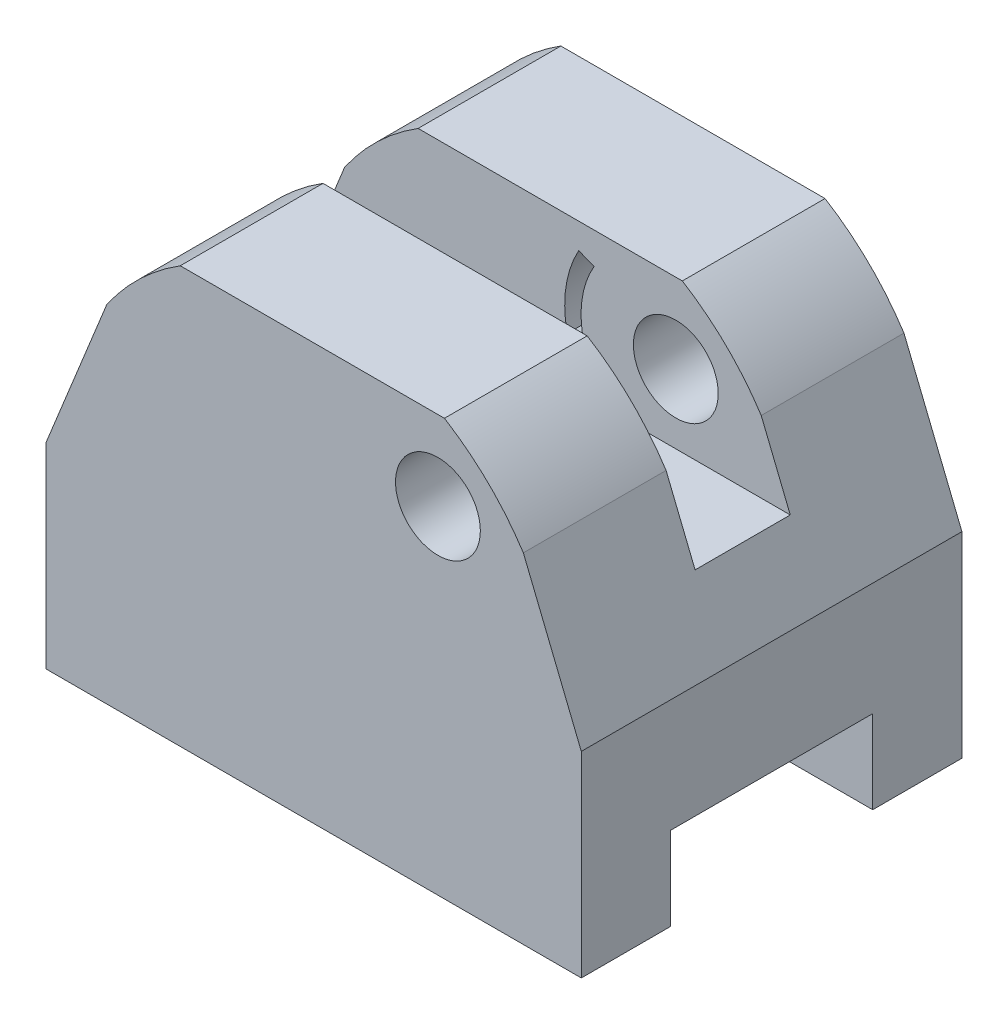
ISO-10303-21;
HEADER;
FILE_DESCRIPTION(('STEP AP214'),'2;1');
FILE_NAME('part.step','',(''),(''),'','','');
FILE_SCHEMA(('AUTOMOTIVE_DESIGN { 1 0 10303 214 1 1 1 1 }'));
ENDSEC;
DATA;
#1=APPLICATION_CONTEXT('core data for automotive mechanical design processes');
#2=APPLICATION_PROTOCOL_DEFINITION('international standard','automotive_design',2000,#1);
#3=PRODUCT_CONTEXT('',#1,'mechanical');
#4=PRODUCT('Part','Part','',(#3));
#5=PRODUCT_RELATED_PRODUCT_CATEGORY('part','',(#4));
#6=PRODUCT_DEFINITION_FORMATION('','',#4);
#7=PRODUCT_DEFINITION_CONTEXT('part definition',#1,'design');
#8=PRODUCT_DEFINITION('design','',#6,#7);
#9=PRODUCT_DEFINITION_SHAPE('','',#8);
#10=(LENGTH_UNIT() NAMED_UNIT(*) SI_UNIT(.MILLI.,.METRE.));
#11=(NAMED_UNIT(*) PLANE_ANGLE_UNIT() SI_UNIT($,.RADIAN.));
#12=(NAMED_UNIT(*) SI_UNIT($,.STERADIAN.) SOLID_ANGLE_UNIT());
#13=UNCERTAINTY_MEASURE_WITH_UNIT(LENGTH_MEASURE(1.E-05),#10,'distance_accuracy_value','');
#14=(GEOMETRIC_REPRESENTATION_CONTEXT(3) GLOBAL_UNCERTAINTY_ASSIGNED_CONTEXT((#13)) GLOBAL_UNIT_ASSIGNED_CONTEXT((#10,
#11,#12)) REPRESENTATION_CONTEXT('',''));
#15=CARTESIAN_POINT('',(0.,0.,0.));
#16=DIRECTION('',(0.,0.,1.));
#17=DIRECTION('',(1.,0.,0.));
#18=AXIS2_PLACEMENT_3D('',#15,#16,#17);
#19=CARTESIAN_POINT('',(0.,53.5,0.));
#20=DIRECTION('',(0.,-1.,0.));
#21=DIRECTION('',(0.,0.,-1.));
#22=AXIS2_PLACEMENT_3D('',#19,#20,#21);
#23=PLANE('',#22);
#24=DIRECTION('',(-1.,0.,0.));
#25=VECTOR('',#24,1.);
#26=CARTESIAN_POINT('',(0.,53.5,-32.));
#27=LINE('',#26,#25);
#28=CARTESIAN_POINT('',(66.9827236108267,53.5,-32.));
#29=VERTEX_POINT('',#28);
#30=CARTESIAN_POINT('',(22.5592698271082,53.5,-32.));
#31=VERTEX_POINT('',#30);
#32=EDGE_CURVE('E340',#29,#31,#27,.T.);
#33=ORIENTED_EDGE('',*,*,#32,.T.);
#34=DIRECTION('',(0.,0.,1.));
#35=VECTOR('',#34,1.);
#36=CARTESIAN_POINT('',(22.5592698271082,53.5,-32.));
#37=LINE('',#36,#35);
#38=CARTESIAN_POINT('',(22.5592698271082,53.5,-8.00000000000001));
#39=VERTEX_POINT('',#38);
#40=EDGE_CURVE('E288',#31,#39,#37,.T.);
#41=ORIENTED_EDGE('',*,*,#40,.T.);
#42=DIRECTION('',(-1.,0.,0.));
#43=VECTOR('',#42,1.);
#44=CARTESIAN_POINT('',(90.,53.5,-8.00000000000001));
#45=LINE('',#44,#43);
#46=CARTESIAN_POINT('',(66.9827236108267,53.5,-8.00000000000001));
#47=VERTEX_POINT('',#46);
#48=EDGE_CURVE('E337',#47,#39,#45,.T.);
#49=ORIENTED_EDGE('',*,*,#48,.F.);
#50=DIRECTION('',(0.,0.,1.));
#51=VECTOR('',#50,1.);
#52=CARTESIAN_POINT('',(66.9827236108267,53.5,-32.));
#53=LINE('',#52,#51);
#54=EDGE_CURVE('E284',#29,#47,#53,.T.);
#55=ORIENTED_EDGE('',*,*,#54,.F.);
#56=EDGE_LOOP('',(#33,#41,#49,#55));
#57=FACE_BOUND('',#56,.T.);
#58=ADVANCED_FACE('F34',(#57),#23,.F.);
#59=CARTESIAN_POINT('',(90.,-16.5,32.));
#60=DIRECTION('',(0.,1.,0.));
#61=DIRECTION('',(0.,0.,1.));
#62=AXIS2_PLACEMENT_3D('',#59,#60,#61);
#63=PLANE('',#62);
#64=DIRECTION('',(-1.,0.,0.));
#65=VECTOR('',#64,1.);
#66=CARTESIAN_POINT('',(90.,-16.5,-17.));
#67=LINE('',#66,#65);
#68=CARTESIAN_POINT('',(90.,-16.5,-17.));
#69=VERTEX_POINT('',#68);
#70=CARTESIAN_POINT('',(0.,-16.5,-17.));
#71=VERTEX_POINT('',#70);
#72=EDGE_CURVE('E363',#69,#71,#67,.T.);
#73=ORIENTED_EDGE('',*,*,#72,.T.);
#74=DIRECTION('',(0.,0.,-1.));
#75=VECTOR('',#74,1.);
#76=CARTESIAN_POINT('',(0.,-16.5,32.));
#77=LINE('',#76,#75);
#78=CARTESIAN_POINT('',(0.,-16.5,-32.));
#79=VERTEX_POINT('',#78);
#80=EDGE_CURVE('E396',#71,#79,#77,.T.);
#81=ORIENTED_EDGE('',*,*,#80,.T.);
#82=DIRECTION('',(-1.,0.,0.));
#83=VECTOR('',#82,1.);
#84=CARTESIAN_POINT('',(90.,-16.5,-32.));
#85=LINE('',#84,#83);
#86=CARTESIAN_POINT('',(90.,-16.5,-32.));
#87=VERTEX_POINT('',#86);
#88=EDGE_CURVE('E391',#87,#79,#85,.T.);
#89=ORIENTED_EDGE('',*,*,#88,.F.);
#90=DIRECTION('',(0.,0.,-1.));
#91=VECTOR('',#90,1.);
#92=CARTESIAN_POINT('',(90.,-16.5,32.));
#93=LINE('',#92,#91);
#94=EDGE_CURVE('E387',#69,#87,#93,.T.);
#95=ORIENTED_EDGE('',*,*,#94,.F.);
#96=EDGE_LOOP('',(#73,#81,#89,#95));
#97=FACE_BOUND('',#96,.T.);
#98=ADVANCED_FACE('F456',(#97),#63,.F.);
#99=CARTESIAN_POINT('',(90.,0.,0.));
#100=DIRECTION('',(-1.,0.,0.));
#101=DIRECTION('',(0.,0.,1.));
#102=AXIS2_PLACEMENT_3D('',#99,#100,#101);
#103=PLANE('',#102);
#104=DIRECTION('',(0.,1.,0.));
#105=VECTOR('',#104,1.);
#106=CARTESIAN_POINT('',(90.,-16.5,-32.));
#107=LINE('',#106,#105);
#108=CARTESIAN_POINT('',(90.,16.5,-32.));
#109=VERTEX_POINT('',#108);
#110=EDGE_CURVE('E381',#87,#109,#107,.T.);
#111=ORIENTED_EDGE('',*,*,#110,.T.);
#112=DIRECTION('',(0.,0.,1.));
#113=VECTOR('',#112,1.);
#114=CARTESIAN_POINT('',(90.,16.5,-32.));
#115=LINE('',#114,#113);
#116=CARTESIAN_POINT('',(90.,16.5,32.));
#117=VERTEX_POINT('',#116);
#118=EDGE_CURVE('E319',#109,#117,#115,.T.);
#119=ORIENTED_EDGE('',*,*,#118,.T.);
#120=DIRECTION('',(0.,-1.,0.));
#121=VECTOR('',#120,1.);
#122=CARTESIAN_POINT('',(90.,-16.5,32.));
#123=LINE('',#122,#121);
#124=CARTESIAN_POINT('',(90.,-16.5,32.));
#125=VERTEX_POINT('',#124);
#126=EDGE_CURVE('E384',#117,#125,#123,.T.);
#127=ORIENTED_EDGE('',*,*,#126,.T.);
#128=CARTESIAN_POINT('',(90.,-16.5,17.));
#129=VERTEX_POINT('',#128);
#130=EDGE_CURVE('E388',#125,#129,#93,.T.);
#131=ORIENTED_EDGE('',*,*,#130,.T.);
#132=DIRECTION('',(0.,1.,0.));
#133=VECTOR('',#132,1.);
#134=CARTESIAN_POINT('',(90.,-16.5,17.));
#135=LINE('',#134,#133);
#136=CARTESIAN_POINT('',(90.,-2.5,17.));
#137=VERTEX_POINT('',#136);
#138=EDGE_CURVE('E360',#129,#137,#135,.T.);
#139=ORIENTED_EDGE('',*,*,#138,.T.);
#140=DIRECTION('',(0.,0.,1.));
#141=VECTOR('',#140,1.);
#142=CARTESIAN_POINT('',(90.,-2.5,-17.));
#143=LINE('',#142,#141);
#144=CARTESIAN_POINT('',(90.,-2.5,-17.));
#145=VERTEX_POINT('',#144);
#146=EDGE_CURVE('E357',#145,#137,#143,.T.);
#147=ORIENTED_EDGE('',*,*,#146,.F.);
#148=DIRECTION('',(0.,1.,0.));
#149=VECTOR('',#148,1.);
#150=CARTESIAN_POINT('',(90.,-16.5,-17.));
#151=LINE('',#150,#149);
#152=EDGE_CURVE('E355',#69,#145,#151,.T.);
#153=ORIENTED_EDGE('',*,*,#152,.F.);
#154=ORIENTED_EDGE('',*,*,#94,.T.);
#155=EDGE_LOOP('',(#111,#119,#127,#131,#139,#147,#153,#154));
#156=FACE_BOUND('',#155,.T.);
#157=ADVANCED_FACE('F463',(#156),#103,.F.);
#158=CARTESIAN_POINT('',(0.,0.,0.));
#159=DIRECTION('',(-1.,0.,0.));
#160=DIRECTION('',(0.,0.,1.));
#161=AXIS2_PLACEMENT_3D('',#158,#159,#160);
#162=PLANE('',#161);
#163=DIRECTION('',(0.,0.,1.));
#164=VECTOR('',#163,1.);
#165=CARTESIAN_POINT('',(0.,16.5,-32.));
#166=LINE('',#165,#164);
#167=CARTESIAN_POINT('',(0.,16.5,-32.));
#168=VERTEX_POINT('',#167);
#169=CARTESIAN_POINT('',(0.,16.5,32.));
#170=VERTEX_POINT('',#169);
#171=EDGE_CURVE('E315',#168,#170,#166,.T.);
#172=ORIENTED_EDGE('',*,*,#171,.F.);
#173=DIRECTION('',(0.,1.,0.));
#174=VECTOR('',#173,1.);
#175=CARTESIAN_POINT('',(0.,-16.5,-32.));
#176=LINE('',#175,#174);
#177=EDGE_CURVE('E380',#79,#168,#176,.T.);
#178=ORIENTED_EDGE('',*,*,#177,.F.);
#179=ORIENTED_EDGE('',*,*,#80,.F.);
#180=DIRECTION('',(0.,1.,0.));
#181=VECTOR('',#180,1.);
#182=CARTESIAN_POINT('',(0.,-16.5,-17.));
#183=LINE('',#182,#181);
#184=CARTESIAN_POINT('',(0.,-2.5,-17.));
#185=VERTEX_POINT('',#184);
#186=EDGE_CURVE('E354',#71,#185,#183,.T.);
#187=ORIENTED_EDGE('',*,*,#186,.T.);
#188=DIRECTION('',(0.,0.,1.));
#189=VECTOR('',#188,1.);
#190=CARTESIAN_POINT('',(0.,-2.5,-17.));
#191=LINE('',#190,#189);
#192=CARTESIAN_POINT('',(0.,-2.5,17.));
#193=VERTEX_POINT('',#192);
#194=EDGE_CURVE('E366',#185,#193,#191,.T.);
#195=ORIENTED_EDGE('',*,*,#194,.T.);
#196=DIRECTION('',(0.,1.,0.));
#197=VECTOR('',#196,1.);
#198=CARTESIAN_POINT('',(0.,-16.5,17.));
#199=LINE('',#198,#197);
#200=CARTESIAN_POINT('',(0.,-16.5,17.));
#201=VERTEX_POINT('',#200);
#202=EDGE_CURVE('E358',#201,#193,#199,.T.);
#203=ORIENTED_EDGE('',*,*,#202,.F.);
#204=CARTESIAN_POINT('',(0.,-16.5,32.));
#205=VERTEX_POINT('',#204);
#206=EDGE_CURVE('E385',#205,#201,#77,.T.);
#207=ORIENTED_EDGE('',*,*,#206,.F.);
#208=DIRECTION('',(0.,-1.,0.));
#209=VECTOR('',#208,1.);
#210=CARTESIAN_POINT('',(0.,-16.5,32.));
#211=LINE('',#210,#209);
#212=EDGE_CURVE('E394',#170,#205,#211,.T.);
#213=ORIENTED_EDGE('',*,*,#212,.F.);
#214=EDGE_LOOP('',(#172,#178,#179,#187,#195,#203,#207,#213));
#215=FACE_BOUND('',#214,.T.);
#216=ADVANCED_FACE('F500',(#215),#162,.T.);
#217=CARTESIAN_POINT('',(90.,-16.5,-32.));
#218=DIRECTION('',(0.,0.,1.));
#219=DIRECTION('',(1.,0.,0.));
#220=AXIS2_PLACEMENT_3D('',#217,#218,#219);
#221=PLANE('',#220);
#222=CARTESIAN_POINT('',(65.8903112918487,40.1233038799305,-32.));
#223=DIRECTION('',(0.,0.,1.));
#224=DIRECTION('',(1.,0.,0.));
#225=AXIS2_PLACEMENT_3D('',#222,#223,#224);
#226=CIRCLE('',#225,7.1318074364327);
#227=CARTESIAN_POINT('',(73.0221187282814,40.1233038799305,-32.));
#228=VERTEX_POINT('',#227);
#229=EDGE_CURVE('E262',#228,#228,#226,.T.);
#230=ORIENTED_EDGE('',*,*,#229,.T.);
#231=EDGE_LOOP('',(#230));
#232=FACE_BOUND('',#231,.T.);
#233=DIRECTION('',(0.375705108739218,0.926739268223405,0.));
#234=VECTOR('',#233,1.);
#235=CARTESIAN_POINT('',(0.,16.5,-32.));
#236=LINE('',#235,#234);
#237=CARTESIAN_POINT('',(10.1962180835076,41.650671272652,-32.));
#238=VERTEX_POINT('',#237);
#239=EDGE_CURVE('E312',#168,#238,#236,.T.);
#240=ORIENTED_EDGE('',*,*,#239,.T.);
#241=CARTESIAN_POINT('',(45.,17.7121728664032,-32.));
#242=DIRECTION('',(0.,0.,-1.));
#243=DIRECTION('',(-1.,0.,0.));
#244=AXIS2_PLACEMENT_3D('',#241,#242,#243);
#245=CIRCLE('',#244,42.2416256983173);
#246=EDGE_CURVE('E278',#238,#31,#245,.T.);
#247=ORIENTED_EDGE('',*,*,#246,.T.);
#248=ORIENTED_EDGE('',*,*,#32,.F.);
#249=CARTESIAN_POINT('',(45.,17.7121728664032,-32.));
#250=DIRECTION('',(0.,0.,-1.));
#251=DIRECTION('',(1.,0.,0.));
#252=AXIS2_PLACEMENT_3D('',#249,#250,#251);
#253=CIRCLE('',#252,42.0001036700412);
#254=CARTESIAN_POINT('',(80.2528505360971,40.5429686776272,-32.));
#255=VERTEX_POINT('',#254);
#256=EDGE_CURVE('E291',#29,#255,#253,.T.);
#257=ORIENTED_EDGE('',*,*,#256,.T.);
#258=DIRECTION('',(0.375705108739219,-0.926739268223404,0.));
#259=VECTOR('',#258,1.);
#260=CARTESIAN_POINT('',(90.,16.5,-32.));
#261=LINE('',#260,#259);
#262=EDGE_CURVE('E322',#255,#109,#261,.T.);
#263=ORIENTED_EDGE('',*,*,#262,.T.);
#264=ORIENTED_EDGE('',*,*,#110,.F.);
#265=ORIENTED_EDGE('',*,*,#88,.T.);
#266=ORIENTED_EDGE('',*,*,#177,.T.);
#267=EDGE_LOOP('',(#240,#247,#248,#257,#263,#264,#265,#266));
#268=FACE_BOUND('',#267,.T.);
#269=ADVANCED_FACE('F36',(#232,#268),#221,.F.);
#270=CARTESIAN_POINT('',(90.,-16.5,32.));
#271=DIRECTION('',(0.,0.,-1.));
#272=DIRECTION('',(-1.,0.,0.));
#273=AXIS2_PLACEMENT_3D('',#270,#271,#272);
#274=PLANE('',#273);
#275=CARTESIAN_POINT('',(65.8903112918487,40.1233038799305,32.));
#276=DIRECTION('',(0.,0.,1.));
#277=DIRECTION('',(1.,0.,0.));
#278=AXIS2_PLACEMENT_3D('',#275,#276,#277);
#279=CIRCLE('',#278,7.1318074364327);
#280=CARTESIAN_POINT('',(73.0221187282814,40.1233038799305,32.));
#281=VERTEX_POINT('',#280);
#282=EDGE_CURVE('E261',#281,#281,#279,.T.);
#283=ORIENTED_EDGE('',*,*,#282,.F.);
#284=EDGE_LOOP('',(#283));
#285=FACE_BOUND('',#284,.T.);
#286=DIRECTION('',(1.,0.,0.));
#287=VECTOR('',#286,1.);
#288=CARTESIAN_POINT('',(0.,53.5,32.));
#289=LINE('',#288,#287);
#290=CARTESIAN_POINT('',(22.5592698271082,53.5,32.));
#291=VERTEX_POINT('',#290);
#292=CARTESIAN_POINT('',(66.9827236108267,53.5,32.));
#293=VERTEX_POINT('',#292);
#294=EDGE_CURVE('E351',#291,#293,#289,.T.);
#295=ORIENTED_EDGE('',*,*,#294,.F.);
#296=CARTESIAN_POINT('',(45.,17.7121728664032,32.));
#297=DIRECTION('',(0.,0.,-1.));
#298=DIRECTION('',(-1.,0.,0.));
#299=AXIS2_PLACEMENT_3D('',#296,#297,#298);
#300=CIRCLE('',#299,42.2416256983173);
#301=CARTESIAN_POINT('',(10.1962180835076,41.650671272652,32.));
#302=VERTEX_POINT('',#301);
#303=EDGE_CURVE('E282',#302,#291,#300,.T.);
#304=ORIENTED_EDGE('',*,*,#303,.F.);
#305=DIRECTION('',(0.375705108739218,0.926739268223405,0.));
#306=VECTOR('',#305,1.);
#307=CARTESIAN_POINT('',(0.,16.5,32.));
#308=LINE('',#307,#306);
#309=EDGE_CURVE('E316',#170,#302,#308,.T.);
#310=ORIENTED_EDGE('',*,*,#309,.F.);
#311=ORIENTED_EDGE('',*,*,#212,.T.);
#312=DIRECTION('',(-1.,0.,0.));
#313=VECTOR('',#312,1.);
#314=CARTESIAN_POINT('',(90.,-16.5,32.));
#315=LINE('',#314,#313);
#316=EDGE_CURVE('E401',#125,#205,#315,.T.);
#317=ORIENTED_EDGE('',*,*,#316,.F.);
#318=ORIENTED_EDGE('',*,*,#126,.F.);
#319=DIRECTION('',(0.375705108739219,-0.926739268223404,0.));
#320=VECTOR('',#319,1.);
#321=CARTESIAN_POINT('',(90.,16.5,32.));
#322=LINE('',#321,#320);
#323=CARTESIAN_POINT('',(80.2528505360971,40.5429686776272,32.));
#324=VERTEX_POINT('',#323);
#325=EDGE_CURVE('E311',#324,#117,#322,.T.);
#326=ORIENTED_EDGE('',*,*,#325,.F.);
#327=CARTESIAN_POINT('',(45.,17.7121728664032,32.));
#328=DIRECTION('',(0.,0.,-1.));
#329=DIRECTION('',(1.,0.,0.));
#330=AXIS2_PLACEMENT_3D('',#327,#328,#329);
#331=CIRCLE('',#330,42.0001036700412);
#332=EDGE_CURVE('E275',#293,#324,#331,.T.);
#333=ORIENTED_EDGE('',*,*,#332,.F.);
#334=EDGE_LOOP('',(#295,#304,#310,#311,#317,#318,#326,#333));
#335=FACE_BOUND('',#334,.T.);
#336=ADVANCED_FACE('F496',(#285,#335),#274,.F.);
#337=ORIENTED_EDGE('',*,*,#206,.T.);
#338=DIRECTION('',(-1.,0.,0.));
#339=VECTOR('',#338,1.);
#340=CARTESIAN_POINT('',(90.,-16.5,17.));
#341=LINE('',#340,#339);
#342=EDGE_CURVE('E373',#129,#201,#341,.T.);
#343=ORIENTED_EDGE('',*,*,#342,.F.);
#344=ORIENTED_EDGE('',*,*,#130,.F.);
#345=ORIENTED_EDGE('',*,*,#316,.T.);
#346=EDGE_LOOP('',(#337,#343,#344,#345));
#347=FACE_BOUND('',#346,.T.);
#348=ADVANCED_FACE('F466',(#347),#63,.F.);
#349=CARTESIAN_POINT('',(90.,-16.5,-17.));
#350=DIRECTION('',(0.,0.,1.));
#351=DIRECTION('',(1.,0.,0.));
#352=AXIS2_PLACEMENT_3D('',#349,#350,#351);
#353=PLANE('',#352);
#354=ORIENTED_EDGE('',*,*,#186,.F.);
#355=ORIENTED_EDGE('',*,*,#72,.F.);
#356=ORIENTED_EDGE('',*,*,#152,.T.);
#357=DIRECTION('',(-1.,0.,0.));
#358=VECTOR('',#357,1.);
#359=CARTESIAN_POINT('',(90.,-2.5,-17.));
#360=LINE('',#359,#358);
#361=EDGE_CURVE('E377',#145,#185,#360,.T.);
#362=ORIENTED_EDGE('',*,*,#361,.T.);
#363=EDGE_LOOP('',(#354,#355,#356,#362));
#364=FACE_BOUND('',#363,.T.);
#365=ADVANCED_FACE('F557',(#364),#353,.T.);
#366=CARTESIAN_POINT('',(90.,-2.5,-17.));
#367=DIRECTION('',(0.,-1.,0.));
#368=DIRECTION('',(0.,0.,-1.));
#369=AXIS2_PLACEMENT_3D('',#366,#367,#368);
#370=PLANE('',#369);
#371=ORIENTED_EDGE('',*,*,#194,.F.);
#372=ORIENTED_EDGE('',*,*,#361,.F.);
#373=ORIENTED_EDGE('',*,*,#146,.T.);
#374=DIRECTION('',(-1.,0.,0.));
#375=VECTOR('',#374,1.);
#376=CARTESIAN_POINT('',(90.,-2.5,17.));
#377=LINE('',#376,#375);
#378=EDGE_CURVE('E375',#137,#193,#377,.T.);
#379=ORIENTED_EDGE('',*,*,#378,.T.);
#380=EDGE_LOOP('',(#371,#372,#373,#379));
#381=FACE_BOUND('',#380,.T.);
#382=ADVANCED_FACE('F478',(#381),#370,.T.);
#383=CARTESIAN_POINT('',(90.,-16.5,17.));
#384=DIRECTION('',(0.,0.,1.));
#385=DIRECTION('',(1.,0.,0.));
#386=AXIS2_PLACEMENT_3D('',#383,#384,#385);
#387=PLANE('',#386);
#388=ORIENTED_EDGE('',*,*,#202,.T.);
#389=ORIENTED_EDGE('',*,*,#378,.F.);
#390=ORIENTED_EDGE('',*,*,#138,.F.);
#391=ORIENTED_EDGE('',*,*,#342,.T.);
#392=EDGE_LOOP('',(#388,#389,#390,#391));
#393=FACE_BOUND('',#392,.T.);
#394=ADVANCED_FACE('F471',(#393),#387,.F.);
#395=DIRECTION('',(-1.,0.,0.));
#396=VECTOR('',#395,1.);
#397=CARTESIAN_POINT('',(90.,53.5,8.));
#398=LINE('',#397,#396);
#399=CARTESIAN_POINT('',(66.9827236108267,53.5,7.99999999999999));
#400=VERTEX_POINT('',#399);
#401=CARTESIAN_POINT('',(22.5592698271082,53.5,7.99999999999999));
#402=VERTEX_POINT('',#401);
#403=EDGE_CURVE('E341',#400,#402,#398,.T.);
#404=ORIENTED_EDGE('',*,*,#403,.T.);
#405=EDGE_CURVE('E281',#402,#291,#37,.T.);
#406=ORIENTED_EDGE('',*,*,#405,.T.);
#407=ORIENTED_EDGE('',*,*,#294,.T.);
#408=EDGE_CURVE('E297',#400,#293,#53,.T.);
#409=ORIENTED_EDGE('',*,*,#408,.F.);
#410=EDGE_LOOP('',(#404,#406,#407,#409));
#411=FACE_BOUND('',#410,.T.);
#412=ADVANCED_FACE('F459',(#411),#23,.F.);
#413=CARTESIAN_POINT('',(90.,53.5,-8.00000000000001));
#414=DIRECTION('',(0.,0.,-1.));
#415=DIRECTION('',(0.,1.,0.));
#416=AXIS2_PLACEMENT_3D('',#413,#414,#415);
#417=PLANE('',#416);
#418=DIRECTION('',(-0.900351482992425,-0.435163425707333,0.));
#419=VECTOR('',#418,1.);
#420=CARTESIAN_POINT('',(88.766475495771,56.0521575368722,-8.00000000000001));
#421=LINE('',#420,#419);
#422=CARTESIAN_POINT('',(50.1910244620928,37.407632884979,-8.00000000000001));
#423=VERTEX_POINT('',#422);
#424=CARTESIAN_POINT('',(47.630804887401,36.1702117869619,-8.00000000000001));
#425=VERTEX_POINT('',#424);
#426=EDGE_CURVE('E246',#423,#425,#421,.T.);
#427=ORIENTED_EDGE('',*,*,#426,.T.);
#428=CARTESIAN_POINT('',(65.8903112918487,40.1233038799305,-8.00000000000001));
#429=DIRECTION('',(0.,0.,-1.));
#430=DIRECTION('',(0.,1.,0.));
#431=AXIS2_PLACEMENT_3D('',#428,#429,#430);
#432=CIRCLE('',#431,18.6825188673679);
#433=CARTESIAN_POINT('',(49.5680509920734,49.2128764736191,-8.00000000000001));
#434=VERTEX_POINT('',#433);
#435=EDGE_CURVE('E212',#425,#434,#432,.T.);
#436=ORIENTED_EDGE('',*,*,#435,.T.);
#437=DIRECTION('',(0.928005180372148,-0.372567289496082,0.));
#438=VECTOR('',#437,1.);
#439=CARTESIAN_POINT('',(82.9055384686741,35.8288376660061,-8.00000000000001));
#440=LINE('',#439,#438);
#441=CARTESIAN_POINT('',(52.1442391806511,48.1786112874428,-8.00000000000001));
#442=VERTEX_POINT('',#441);
#443=EDGE_CURVE('E257',#434,#442,#440,.T.);
#444=ORIENTED_EDGE('',*,*,#443,.T.);
#445=CARTESIAN_POINT('',(65.8903112918487,40.1233038799305,-8.00000000000001));
#446=DIRECTION('',(0.,0.,-1.));
#447=DIRECTION('',(0.,1.,0.));
#448=AXIS2_PLACEMENT_3D('',#445,#446,#447);
#449=CIRCLE('',#448,15.9324347139967);
#450=EDGE_CURVE('E254',#442,#423,#449,.F.);
#451=ORIENTED_EDGE('',*,*,#450,.T.);
#452=EDGE_LOOP('',(#427,#436,#444,#451));
#453=FACE_BOUND('',#452,.T.);
#454=CARTESIAN_POINT('',(65.8903112918487,40.1233038799305,-8.00000000000001));
#455=DIRECTION('',(0.,0.,-1.));
#456=DIRECTION('',(0.,1.,0.));
#457=AXIS2_PLACEMENT_3D('',#454,#455,#456);
#458=CIRCLE('',#457,7.1318074364327);
#459=CARTESIAN_POINT('',(65.8903112918487,47.2551113163632,-8.00000000000001));
#460=VERTEX_POINT('',#459);
#461=EDGE_CURVE('E268',#460,#460,#458,.T.);
#462=ORIENTED_EDGE('',*,*,#461,.T.);
#463=EDGE_LOOP('',(#462));
#464=FACE_BOUND('',#463,.T.);
#465=ORIENTED_EDGE('',*,*,#48,.T.);
#466=CARTESIAN_POINT('',(45.,17.7121728664032,-8.00000000000001));
#467=DIRECTION('',(0.,0.,-1.));
#468=DIRECTION('',(0.,1.,0.));
#469=AXIS2_PLACEMENT_3D('',#466,#467,#468);
#470=CIRCLE('',#469,42.2416256983173);
#471=CARTESIAN_POINT('',(10.1962180835076,41.650671272652,-8.00000000000001));
#472=VERTEX_POINT('',#471);
#473=EDGE_CURVE('E302',#39,#472,#470,.F.);
#474=ORIENTED_EDGE('',*,*,#473,.T.);
#475=DIRECTION('',(-0.375705108739218,-0.926739268223405,0.));
#476=VECTOR('',#475,1.);
#477=CARTESIAN_POINT('',(25.5865746549561,79.6135508155583,-8.00000000000001));
#478=LINE('',#477,#476);
#479=CARTESIAN_POINT('',(4.86486486486487,28.5,-8.00000000000001));
#480=VERTEX_POINT('',#479);
#481=EDGE_CURVE('E334',#472,#480,#478,.T.);
#482=ORIENTED_EDGE('',*,*,#481,.T.);
#483=DIRECTION('',(-1.,0.,0.));
#484=VECTOR('',#483,1.);
#485=CARTESIAN_POINT('',(90.,28.5,-8.00000000000001));
#486=LINE('',#485,#484);
#487=CARTESIAN_POINT('',(85.1351351351352,28.5,-8.00000000000001));
#488=VERTEX_POINT('',#487);
#489=EDGE_CURVE('E336',#488,#480,#486,.T.);
#490=ORIENTED_EDGE('',*,*,#489,.F.);
#491=DIRECTION('',(-0.375705108739219,0.926739268223405,0.));
#492=VECTOR('',#491,1.);
#493=CARTESIAN_POINT('',(77.1173149309912,48.2772898368883,-8.00000000000001));
#494=LINE('',#493,#492);
#495=CARTESIAN_POINT('',(80.2528505360971,40.5429686776272,-8.00000000000001));
#496=VERTEX_POINT('',#495);
#497=EDGE_CURVE('E328',#488,#496,#494,.T.);
#498=ORIENTED_EDGE('',*,*,#497,.T.);
#499=CARTESIAN_POINT('',(45.,17.7121728664032,-8.00000000000001));
#500=DIRECTION('',(0.,0.,-1.));
#501=DIRECTION('',(0.,1.,0.));
#502=AXIS2_PLACEMENT_3D('',#499,#500,#501);
#503=CIRCLE('',#502,42.0001036700412);
#504=EDGE_CURVE('E308',#496,#47,#503,.F.);
#505=ORIENTED_EDGE('',*,*,#504,.T.);
#506=EDGE_LOOP('',(#465,#474,#482,#490,#498,#505));
#507=FACE_BOUND('',#506,.T.);
#508=ADVANCED_FACE('F470',(#453,#464,#507),#417,.F.);
#509=CARTESIAN_POINT('',(90.,28.5,7.99999999999999));
#510=DIRECTION('',(0.,0.,1.));
#511=DIRECTION('',(0.,-1.,0.));
#512=AXIS2_PLACEMENT_3D('',#509,#510,#511);
#513=PLANE('',#512);
#514=DIRECTION('',(-0.928005180372148,0.372567289496082,0.));
#515=VECTOR('',#514,1.);
#516=CARTESIAN_POINT('',(91.5491478359134,32.3586780359447,7.99999999999999));
#517=LINE('',#516,#515);
#518=CARTESIAN_POINT('',(52.1442391806511,48.1786112874428,7.99999999999999));
#519=VERTEX_POINT('',#518);
#520=CARTESIAN_POINT('',(49.5680509920734,49.2128764736191,7.99999999999999));
#521=VERTEX_POINT('',#520);
#522=EDGE_CURVE('E42',#519,#521,#517,.T.);
#523=ORIENTED_EDGE('',*,*,#522,.T.);
#524=CARTESIAN_POINT('',(65.8903112918487,40.1233038799305,8.));
#525=DIRECTION('',(0.,0.,1.));
#526=DIRECTION('',(0.,-1.,0.));
#527=AXIS2_PLACEMENT_3D('',#524,#525,#526);
#528=CIRCLE('',#527,18.6825188673679);
#529=CARTESIAN_POINT('',(47.630804887401,36.1702117869619,7.99999999999999));
#530=VERTEX_POINT('',#529);
#531=EDGE_CURVE('E11',#521,#530,#528,.T.);
#532=ORIENTED_EDGE('',*,*,#531,.T.);
#533=DIRECTION('',(0.900351482992425,0.435163425707333,0.));
#534=VECTOR('',#533,1.);
#535=CARTESIAN_POINT('',(78.9714746037795,51.3179773600387,8.));
#536=LINE('',#535,#534);
#537=CARTESIAN_POINT('',(50.1910244620928,37.407632884979,7.99999999999999));
#538=VERTEX_POINT('',#537);
#539=EDGE_CURVE('E416',#530,#538,#536,.T.);
#540=ORIENTED_EDGE('',*,*,#539,.T.);
#541=CARTESIAN_POINT('',(65.8903112918487,40.1233038799305,8.));
#542=DIRECTION('',(0.,0.,1.));
#543=DIRECTION('',(0.,-1.,0.));
#544=AXIS2_PLACEMENT_3D('',#541,#542,#543);
#545=CIRCLE('',#544,15.9324347139967);
#546=EDGE_CURVE('E421',#538,#519,#545,.F.);
#547=ORIENTED_EDGE('',*,*,#546,.T.);
#548=EDGE_LOOP('',(#523,#532,#540,#547));
#549=FACE_BOUND('',#548,.T.);
#550=CARTESIAN_POINT('',(65.8903112918487,40.1233038799305,7.99999999999999));
#551=DIRECTION('',(0.,0.,1.));
#552=DIRECTION('',(0.,-1.,0.));
#553=AXIS2_PLACEMENT_3D('',#550,#551,#552);
#554=CIRCLE('',#553,7.1318074364327);
#555=CARTESIAN_POINT('',(65.8903112918487,32.9914964434978,7.99999999999999));
#556=VERTEX_POINT('',#555);
#557=EDGE_CURVE('E265',#556,#556,#554,.T.);
#558=ORIENTED_EDGE('',*,*,#557,.T.);
#559=EDGE_LOOP('',(#558));
#560=FACE_BOUND('',#559,.T.);
#561=DIRECTION('',(0.375705108739218,0.926739268223405,0.));
#562=VECTOR('',#561,1.);
#563=CARTESIAN_POINT('',(16.8820577164366,58.142409033877,8.));
#564=LINE('',#563,#562);
#565=CARTESIAN_POINT('',(4.8648648648649,28.5,7.99999999999999));
#566=VERTEX_POINT('',#565);
#567=CARTESIAN_POINT('',(10.1962180835076,41.650671272652,7.99999999999999));
#568=VERTEX_POINT('',#567);
#569=EDGE_CURVE('E331',#566,#568,#564,.T.);
#570=ORIENTED_EDGE('',*,*,#569,.T.);
#571=CARTESIAN_POINT('',(45.,17.7121728664032,7.99999999999999));
#572=DIRECTION('',(0.,0.,1.));
#573=DIRECTION('',(0.,-1.,0.));
#574=AXIS2_PLACEMENT_3D('',#571,#572,#573);
#575=CIRCLE('',#574,42.2416256983173);
#576=EDGE_CURVE('E287',#568,#402,#575,.F.);
#577=ORIENTED_EDGE('',*,*,#576,.T.);
#578=ORIENTED_EDGE('',*,*,#403,.F.);
#579=CARTESIAN_POINT('',(45.,17.7121728664032,7.99999999999999));
#580=DIRECTION('',(0.,0.,1.));
#581=DIRECTION('',(0.,-1.,0.));
#582=AXIS2_PLACEMENT_3D('',#579,#580,#581);
#583=CIRCLE('',#582,42.0001036700412);
#584=CARTESIAN_POINT('',(80.2528505360971,40.5429686776272,7.99999999999999));
#585=VERTEX_POINT('',#584);
#586=EDGE_CURVE('E305',#400,#585,#583,.F.);
#587=ORIENTED_EDGE('',*,*,#586,.T.);
#588=DIRECTION('',(0.375705108739219,-0.926739268223405,0.));
#589=VECTOR('',#588,1.);
#590=CARTESIAN_POINT('',(85.8218318695107,26.806148055207,7.99999999999999));
#591=LINE('',#590,#589);
#592=CARTESIAN_POINT('',(85.1351351351352,28.5,7.99999999999999));
#593=VERTEX_POINT('',#592);
#594=EDGE_CURVE('E321',#585,#593,#591,.T.);
#595=ORIENTED_EDGE('',*,*,#594,.T.);
#596=DIRECTION('',(-1.,0.,0.));
#597=VECTOR('',#596,1.);
#598=CARTESIAN_POINT('',(90.,28.5,7.99999999999999));
#599=LINE('',#598,#597);
#600=EDGE_CURVE('E344',#593,#566,#599,.T.);
#601=ORIENTED_EDGE('',*,*,#600,.T.);
#602=EDGE_LOOP('',(#570,#577,#578,#587,#595,#601));
#603=FACE_BOUND('',#602,.T.);
#604=ADVANCED_FACE('F425',(#549,#560,#603),#513,.F.);
#605=CARTESIAN_POINT('',(90.,28.5,-8.00000000000001));
#606=DIRECTION('',(0.,-1.,0.));
#607=DIRECTION('',(0.,0.,-1.));
#608=AXIS2_PLACEMENT_3D('',#605,#606,#607);
#609=PLANE('',#608);
#610=CARTESIAN_POINT('',(18.5598471017556,28.5,-1.30325612623495));
#611=DIRECTION('',(0.,1.,0.));
#612=DIRECTION('',(0.,0.,1.));
#613=AXIS2_PLACEMENT_3D('',#610,#611,#612);
#614=CIRCLE('',#613,3.39618078455351);
#615=CARTESIAN_POINT('',(18.5598471017556,28.5,2.09292465831857));
#616=VERTEX_POINT('',#615);
#617=EDGE_CURVE('E271',#616,#616,#614,.T.);
#618=ORIENTED_EDGE('',*,*,#617,.F.);
#619=EDGE_LOOP('',(#618));
#620=FACE_BOUND('',#619,.T.);
#621=ORIENTED_EDGE('',*,*,#489,.T.);
#622=DIRECTION('',(0.,0.,1.));
#623=VECTOR('',#622,1.);
#624=CARTESIAN_POINT('',(4.86486486486487,28.5,-8.));
#625=LINE('',#624,#623);
#626=EDGE_CURVE('E407',#480,#566,#625,.T.);
#627=ORIENTED_EDGE('',*,*,#626,.T.);
#628=ORIENTED_EDGE('',*,*,#600,.F.);
#629=DIRECTION('',(0.,0.,-1.));
#630=VECTOR('',#629,1.);
#631=CARTESIAN_POINT('',(85.1351351351352,28.5,-8.00000000000001));
#632=LINE('',#631,#630);
#633=EDGE_CURVE('E404',#593,#488,#632,.T.);
#634=ORIENTED_EDGE('',*,*,#633,.T.);
#635=EDGE_LOOP('',(#621,#627,#628,#634));
#636=FACE_BOUND('',#635,.T.);
#637=ADVANCED_FACE('F535',(#620,#636),#609,.F.);
#638=CARTESIAN_POINT('',(90.,16.5,-32.));
#639=DIRECTION('',(-0.926739268223405,-0.375705108739219,0.));
#640=DIRECTION('',(0.375705108739219,-0.926739268223405,0.));
#641=AXIS2_PLACEMENT_3D('',#638,#639,#640);
#642=PLANE('',#641);
#643=ORIENTED_EDGE('',*,*,#262,.F.);
#644=DIRECTION('',(0.,0.,1.));
#645=VECTOR('',#644,1.);
#646=CARTESIAN_POINT('',(80.2528505360971,40.5429686776272,-32.));
#647=LINE('',#646,#645);
#648=EDGE_CURVE('E294',#255,#496,#647,.T.);
#649=ORIENTED_EDGE('',*,*,#648,.T.);
#650=ORIENTED_EDGE('',*,*,#497,.F.);
#651=ORIENTED_EDGE('',*,*,#633,.F.);
#652=ORIENTED_EDGE('',*,*,#594,.F.);
#653=DIRECTION('',(0.,0.,1.));
#654=VECTOR('',#653,1.);
#655=CARTESIAN_POINT('',(80.2528505360971,40.5429686776272,-32.));
#656=LINE('',#655,#654);
#657=EDGE_CURVE('E413',#585,#324,#656,.T.);
#658=ORIENTED_EDGE('',*,*,#657,.T.);
#659=ORIENTED_EDGE('',*,*,#325,.T.);
#660=ORIENTED_EDGE('',*,*,#118,.F.);
#661=EDGE_LOOP('',(#643,#649,#650,#651,#652,#658,#659,#660));
#662=FACE_BOUND('',#661,.T.);
#663=ADVANCED_FACE('F514',(#662),#642,.F.);
#664=CARTESIAN_POINT('',(0.,16.5,-32.));
#665=DIRECTION('',(0.926739268223405,-0.375705108739218,0.));
#666=DIRECTION('',(0.375705108739218,0.926739268223405,0.));
#667=AXIS2_PLACEMENT_3D('',#664,#665,#666);
#668=PLANE('',#667);
#669=ORIENTED_EDGE('',*,*,#309,.T.);
#670=DIRECTION('',(0.,0.,1.));
#671=VECTOR('',#670,1.);
#672=CARTESIAN_POINT('',(10.1962180835076,41.650671272652,-32.));
#673=LINE('',#672,#671);
#674=EDGE_CURVE('E410',#302,#568,#673,.F.);
#675=ORIENTED_EDGE('',*,*,#674,.T.);
#676=ORIENTED_EDGE('',*,*,#569,.F.);
#677=ORIENTED_EDGE('',*,*,#626,.F.);
#678=ORIENTED_EDGE('',*,*,#481,.F.);
#679=DIRECTION('',(0.,0.,1.));
#680=VECTOR('',#679,1.);
#681=CARTESIAN_POINT('',(10.1962180835076,41.650671272652,-32.));
#682=LINE('',#681,#680);
#683=EDGE_CURVE('E285',#238,#472,#682,.T.);
#684=ORIENTED_EDGE('',*,*,#683,.F.);
#685=ORIENTED_EDGE('',*,*,#239,.F.);
#686=ORIENTED_EDGE('',*,*,#171,.T.);
#687=EDGE_LOOP('',(#669,#675,#676,#677,#678,#684,#685,#686));
#688=FACE_BOUND('',#687,.T.);
#689=ADVANCED_FACE('F490',(#688),#668,.F.);
#690=CARTESIAN_POINT('',(45.,17.7121728664032,-32.));
#691=DIRECTION('',(0.,0.,1.));
#692=DIRECTION('',(1.,0.,0.));
#693=AXIS2_PLACEMENT_3D('',#690,#691,#692);
#694=CYLINDRICAL_SURFACE('',#693,42.2416256983173);
#695=ORIENTED_EDGE('',*,*,#40,.F.);
#696=ORIENTED_EDGE('',*,*,#246,.F.);
#697=ORIENTED_EDGE('',*,*,#683,.T.);
#698=ORIENTED_EDGE('',*,*,#473,.F.);
#699=EDGE_LOOP('',(#695,#696,#697,#698));
#700=FACE_BOUND('',#699,.T.);
#701=ADVANCED_FACE('F527',(#700),#694,.T.);
#702=ORIENTED_EDGE('',*,*,#674,.F.);
#703=ORIENTED_EDGE('',*,*,#303,.T.);
#704=ORIENTED_EDGE('',*,*,#405,.F.);
#705=ORIENTED_EDGE('',*,*,#576,.F.);
#706=EDGE_LOOP('',(#702,#703,#704,#705));
#707=FACE_BOUND('',#706,.T.);
#708=ADVANCED_FACE('F487',(#707),#694,.T.);
#709=CARTESIAN_POINT('',(45.,17.7121728664032,-32.));
#710=DIRECTION('',(0.,0.,1.));
#711=DIRECTION('',(1.,0.,0.));
#712=AXIS2_PLACEMENT_3D('',#709,#710,#711);
#713=CYLINDRICAL_SURFACE('',#712,42.0001036700412);
#714=ORIENTED_EDGE('',*,*,#408,.T.);
#715=ORIENTED_EDGE('',*,*,#332,.T.);
#716=ORIENTED_EDGE('',*,*,#657,.F.);
#717=ORIENTED_EDGE('',*,*,#586,.F.);
#718=EDGE_LOOP('',(#714,#715,#716,#717));
#719=FACE_BOUND('',#718,.T.);
#720=ADVANCED_FACE('F517',(#719),#713,.T.);
#721=ORIENTED_EDGE('',*,*,#648,.F.);
#722=ORIENTED_EDGE('',*,*,#256,.F.);
#723=ORIENTED_EDGE('',*,*,#54,.T.);
#724=ORIENTED_EDGE('',*,*,#504,.F.);
#725=EDGE_LOOP('',(#721,#722,#723,#724));
#726=FACE_BOUND('',#725,.T.);
#727=ADVANCED_FACE('F519',(#726),#713,.T.);
#728=CARTESIAN_POINT('',(18.5598471017556,24.5,-1.30325612623495));
#729=DIRECTION('',(0.,1.,0.));
#730=DIRECTION('',(0.,0.,1.));
#731=AXIS2_PLACEMENT_3D('',#728,#729,#730);
#732=CYLINDRICAL_SURFACE('',#731,3.39618078455351);
#733=CARTESIAN_POINT('',(18.5598471017556,24.5,-1.30325612623495));
#734=DIRECTION('',(0.,1.,0.));
#735=DIRECTION('',(0.,0.,1.));
#736=AXIS2_PLACEMENT_3D('',#733,#734,#735);
#737=CIRCLE('',#736,3.39618078455351);
#738=CARTESIAN_POINT('',(18.5598471017556,24.5,2.09292465831857));
#739=VERTEX_POINT('',#738);
#740=EDGE_CURVE('E272',#739,#739,#737,.T.);
#741=ORIENTED_EDGE('',*,*,#740,.F.);
#742=EDGE_LOOP('',(#741));
#743=FACE_BOUND('',#742,.T.);
#744=ORIENTED_EDGE('',*,*,#617,.T.);
#745=EDGE_LOOP('',(#744));
#746=FACE_BOUND('',#745,.T.);
#747=ADVANCED_FACE('F525',(#743,#746),#732,.F.);
#748=CARTESIAN_POINT('',(18.5598471017556,24.5,-1.30325612623495));
#749=DIRECTION('',(0.,1.,0.));
#750=DIRECTION('',(0.,0.,1.));
#751=AXIS2_PLACEMENT_3D('',#748,#749,#750);
#752=PLANE('',#751);
#753=ORIENTED_EDGE('',*,*,#740,.T.);
#754=EDGE_LOOP('',(#753));
#755=FACE_BOUND('',#754,.T.);
#756=ADVANCED_FACE('F584',(#755),#752,.T.);
#757=CARTESIAN_POINT('',(65.8903112918487,40.1233038799305,-32.));
#758=DIRECTION('',(0.,0.,1.));
#759=DIRECTION('',(1.,0.,0.));
#760=AXIS2_PLACEMENT_3D('',#757,#758,#759);
#761=CYLINDRICAL_SURFACE('',#760,7.1318074364327);
#762=ORIENTED_EDGE('',*,*,#282,.T.);
#763=EDGE_LOOP('',(#762));
#764=FACE_BOUND('',#763,.T.);
#765=ORIENTED_EDGE('',*,*,#557,.F.);
#766=EDGE_LOOP('',(#765));
#767=FACE_BOUND('',#766,.T.);
#768=ADVANCED_FACE('F581',(#764,#767),#761,.F.);
#769=ORIENTED_EDGE('',*,*,#229,.F.);
#770=EDGE_LOOP('',(#769));
#771=FACE_BOUND('',#770,.T.);
#772=ORIENTED_EDGE('',*,*,#461,.F.);
#773=EDGE_LOOP('',(#772));
#774=FACE_BOUND('',#773,.T.);
#775=ADVANCED_FACE('F451',(#771,#774),#761,.F.);
#776=CARTESIAN_POINT('',(65.8903112918487,40.1233038799305,15.));
#777=DIRECTION('',(0.,0.,1.));
#778=DIRECTION('',(1.,0.,0.));
#779=AXIS2_PLACEMENT_3D('',#776,#777,#778);
#780=PLANE('',#779);
#781=CARTESIAN_POINT('',(65.8903112918487,40.1233038799305,15.));
#782=DIRECTION('',(0.,0.,1.));
#783=DIRECTION('',(1.,0.,0.));
#784=AXIS2_PLACEMENT_3D('',#781,#782,#783);
#785=CIRCLE('',#784,18.6825188673679);
#786=CARTESIAN_POINT('',(49.5680509920734,49.2128764736191,15.));
#787=VERTEX_POINT('',#786);
#788=CARTESIAN_POINT('',(47.630804887401,36.1702117869619,15.));
#789=VERTEX_POINT('',#788);
#790=EDGE_CURVE('E237',#787,#789,#785,.T.);
#791=ORIENTED_EDGE('',*,*,#790,.F.);
#792=DIRECTION('',(-0.928005180372148,0.372567289496082,0.));
#793=VECTOR('',#792,1.);
#794=CARTESIAN_POINT('',(52.1442391806511,48.1786112874428,15.));
#795=LINE('',#794,#793);
#796=CARTESIAN_POINT('',(52.1442391806511,48.1786112874428,15.));
#797=VERTEX_POINT('',#796);
#798=EDGE_CURVE('E229',#797,#787,#795,.T.);
#799=ORIENTED_EDGE('',*,*,#798,.F.);
#800=CARTESIAN_POINT('',(65.8903112918487,40.1233038799305,15.));
#801=DIRECTION('',(0.,0.,-1.));
#802=DIRECTION('',(1.,0.,0.));
#803=AXIS2_PLACEMENT_3D('',#800,#801,#802);
#804=CIRCLE('',#803,15.9324347139967);
#805=CARTESIAN_POINT('',(50.1910244620928,37.407632884979,15.));
#806=VERTEX_POINT('',#805);
#807=EDGE_CURVE('E232',#806,#797,#804,.T.);
#808=ORIENTED_EDGE('',*,*,#807,.F.);
#809=DIRECTION('',(0.900351482992425,0.435163425707333,0.));
#810=VECTOR('',#809,1.);
#811=CARTESIAN_POINT('',(50.1910244620928,37.407632884979,15.));
#812=LINE('',#811,#810);
#813=EDGE_CURVE('E240',#789,#806,#812,.T.);
#814=ORIENTED_EDGE('',*,*,#813,.F.);
#815=EDGE_LOOP('',(#791,#799,#808,#814));
#816=FACE_BOUND('',#815,.T.);
#817=ADVANCED_FACE('F438',(#816),#780,.F.);
#818=CARTESIAN_POINT('',(50.1910244620928,37.407632884979,-15.));
#819=DIRECTION('',(0.435163425707332,-0.900351482992425,0.));
#820=DIRECTION('',(0.900351482992425,0.435163425707332,0.));
#821=AXIS2_PLACEMENT_3D('',#818,#819,#820);
#822=PLANE('',#821);
#823=DIRECTION('',(0.,0.,1.));
#824=VECTOR('',#823,1.);
#825=CARTESIAN_POINT('',(47.630804887401,36.1702117869619,-15.));
#826=LINE('',#825,#824);
#827=EDGE_CURVE('E214',#530,#789,#826,.T.);
#828=ORIENTED_EDGE('',*,*,#827,.T.);
#829=ORIENTED_EDGE('',*,*,#813,.T.);
#830=DIRECTION('',(0.,0.,1.));
#831=VECTOR('',#830,1.);
#832=CARTESIAN_POINT('',(50.1910244620928,37.407632884979,-15.));
#833=LINE('',#832,#831);
#834=EDGE_CURVE('E57',#538,#806,#833,.T.);
#835=ORIENTED_EDGE('',*,*,#834,.F.);
#836=ORIENTED_EDGE('',*,*,#539,.F.);
#837=EDGE_LOOP('',(#828,#829,#835,#836));
#838=FACE_BOUND('',#837,.T.);
#839=ADVANCED_FACE('F442',(#838),#822,.F.);
#840=CARTESIAN_POINT('',(65.8903112918487,40.1233038799305,-15.));
#841=DIRECTION('',(0.,0.,1.));
#842=DIRECTION('',(1.,0.,0.));
#843=AXIS2_PLACEMENT_3D('',#840,#841,#842);
#844=CYLINDRICAL_SURFACE('',#843,15.9324347139967);
#845=ORIENTED_EDGE('',*,*,#834,.T.);
#846=ORIENTED_EDGE('',*,*,#807,.T.);
#847=DIRECTION('',(0.,0.,1.));
#848=VECTOR('',#847,1.);
#849=CARTESIAN_POINT('',(52.1442391806511,48.1786112874428,-15.));
#850=LINE('',#849,#848);
#851=EDGE_CURVE('E251',#519,#797,#850,.T.);
#852=ORIENTED_EDGE('',*,*,#851,.F.);
#853=ORIENTED_EDGE('',*,*,#546,.F.);
#854=EDGE_LOOP('',(#845,#846,#852,#853));
#855=FACE_BOUND('',#854,.T.);
#856=ADVANCED_FACE('F432',(#855),#844,.T.);
#857=CARTESIAN_POINT('',(52.1442391806511,48.1786112874428,-15.));
#858=DIRECTION('',(0.372567289496082,0.928005180372148,0.));
#859=DIRECTION('',(-0.928005180372148,0.372567289496082,0.));
#860=AXIS2_PLACEMENT_3D('',#857,#858,#859);
#861=PLANE('',#860);
#862=ORIENTED_EDGE('',*,*,#851,.T.);
#863=ORIENTED_EDGE('',*,*,#798,.T.);
#864=DIRECTION('',(0.,0.,1.));
#865=VECTOR('',#864,1.);
#866=CARTESIAN_POINT('',(49.5680509920734,49.2128764736191,-15.));
#867=LINE('',#866,#865);
#868=EDGE_CURVE('E247',#521,#787,#867,.T.);
#869=ORIENTED_EDGE('',*,*,#868,.F.);
#870=ORIENTED_EDGE('',*,*,#522,.F.);
#871=EDGE_LOOP('',(#862,#863,#869,#870));
#872=FACE_BOUND('',#871,.T.);
#873=ADVANCED_FACE('F430',(#872),#861,.F.);
#874=CARTESIAN_POINT('',(65.8903112918487,40.1233038799305,-15.));
#875=DIRECTION('',(0.,0.,1.));
#876=DIRECTION('',(1.,0.,0.));
#877=AXIS2_PLACEMENT_3D('',#874,#875,#876);
#878=CYLINDRICAL_SURFACE('',#877,18.6825188673679);
#879=ORIENTED_EDGE('',*,*,#868,.T.);
#880=ORIENTED_EDGE('',*,*,#790,.T.);
#881=ORIENTED_EDGE('',*,*,#827,.F.);
#882=ORIENTED_EDGE('',*,*,#531,.F.);
#883=EDGE_LOOP('',(#879,#880,#881,#882));
#884=FACE_BOUND('',#883,.T.);
#885=ADVANCED_FACE('F441',(#884),#878,.F.);
#886=CARTESIAN_POINT('',(47.630804887401,36.1702117869619,-15.));
#887=VERTEX_POINT('',#886);
#888=EDGE_CURVE('E49',#887,#425,#826,.T.);
#889=ORIENTED_EDGE('',*,*,#888,.F.);
#890=CARTESIAN_POINT('',(65.8903112918487,40.1233038799305,-15.));
#891=DIRECTION('',(0.,0.,1.));
#892=DIRECTION('',(1.,0.,0.));
#893=AXIS2_PLACEMENT_3D('',#890,#891,#892);
#894=CIRCLE('',#893,18.6825188673679);
#895=CARTESIAN_POINT('',(49.5680509920734,49.2128764736191,-15.));
#896=VERTEX_POINT('',#895);
#897=EDGE_CURVE('E209',#896,#887,#894,.T.);
#898=ORIENTED_EDGE('',*,*,#897,.F.);
#899=EDGE_CURVE('E244',#896,#434,#867,.T.);
#900=ORIENTED_EDGE('',*,*,#899,.T.);
#901=ORIENTED_EDGE('',*,*,#435,.F.);
#902=EDGE_LOOP('',(#889,#898,#900,#901));
#903=FACE_BOUND('',#902,.T.);
#904=ADVANCED_FACE('F206',(#903),#878,.F.);
#905=ORIENTED_EDGE('',*,*,#899,.F.);
#906=DIRECTION('',(-0.928005180372148,0.372567289496082,0.));
#907=VECTOR('',#906,1.);
#908=CARTESIAN_POINT('',(52.1442391806511,48.1786112874428,-15.));
#909=LINE('',#908,#907);
#910=CARTESIAN_POINT('',(52.1442391806511,48.1786112874428,-15.));
#911=VERTEX_POINT('',#910);
#912=EDGE_CURVE('E228',#911,#896,#909,.T.);
#913=ORIENTED_EDGE('',*,*,#912,.F.);
#914=EDGE_CURVE('E248',#911,#442,#850,.T.);
#915=ORIENTED_EDGE('',*,*,#914,.T.);
#916=ORIENTED_EDGE('',*,*,#443,.F.);
#917=EDGE_LOOP('',(#905,#913,#915,#916));
#918=FACE_BOUND('',#917,.T.);
#919=ADVANCED_FACE('F670',(#918),#861,.F.);
#920=ORIENTED_EDGE('',*,*,#914,.F.);
#921=CARTESIAN_POINT('',(65.8903112918487,40.1233038799305,-15.));
#922=DIRECTION('',(0.,0.,-1.));
#923=DIRECTION('',(1.,0.,0.));
#924=AXIS2_PLACEMENT_3D('',#921,#922,#923);
#925=CIRCLE('',#924,15.9324347139967);
#926=CARTESIAN_POINT('',(50.1910244620928,37.407632884979,-15.));
#927=VERTEX_POINT('',#926);
#928=EDGE_CURVE('E224',#927,#911,#925,.T.);
#929=ORIENTED_EDGE('',*,*,#928,.F.);
#930=EDGE_CURVE('E220',#927,#423,#833,.T.);
#931=ORIENTED_EDGE('',*,*,#930,.T.);
#932=ORIENTED_EDGE('',*,*,#450,.F.);
#933=EDGE_LOOP('',(#920,#929,#931,#932));
#934=FACE_BOUND('',#933,.T.);
#935=ADVANCED_FACE('F450',(#934),#844,.T.);
#936=ORIENTED_EDGE('',*,*,#930,.F.);
#937=DIRECTION('',(0.900351482992425,0.435163425707333,0.));
#938=VECTOR('',#937,1.);
#939=CARTESIAN_POINT('',(50.1910244620928,37.407632884979,-15.));
#940=LINE('',#939,#938);
#941=EDGE_CURVE('E217',#887,#927,#940,.T.);
#942=ORIENTED_EDGE('',*,*,#941,.F.);
#943=ORIENTED_EDGE('',*,*,#888,.T.);
#944=ORIENTED_EDGE('',*,*,#426,.F.);
#945=EDGE_LOOP('',(#936,#942,#943,#944));
#946=FACE_BOUND('',#945,.T.);
#947=ADVANCED_FACE('F218',(#946),#822,.F.);
#948=CARTESIAN_POINT('',(65.8903112918487,40.1233038799305,-15.));
#949=DIRECTION('',(0.,0.,1.));
#950=DIRECTION('',(1.,0.,0.));
#951=AXIS2_PLACEMENT_3D('',#948,#949,#950);
#952=PLANE('',#951);
#953=ORIENTED_EDGE('',*,*,#897,.T.);
#954=ORIENTED_EDGE('',*,*,#941,.T.);
#955=ORIENTED_EDGE('',*,*,#928,.T.);
#956=ORIENTED_EDGE('',*,*,#912,.T.);
#957=EDGE_LOOP('',(#953,#954,#955,#956));
#958=FACE_BOUND('',#957,.T.);
#959=ADVANCED_FACE('F226',(#958),#952,.T.);
#960=CLOSED_SHELL('',(#58,#98,#157,#216,#269,#336,#348,#365,#382,#394,#412,#508,#604,#637,#663,
#689,#701,#708,#720,#727,#747,#756,#768,#775,#817,#839,#856,#873,#885,#904,#919,#935,#947,#959));
#961=MANIFOLD_SOLID_BREP('B2',#960);
#962=ADVANCED_BREP_SHAPE_REPRESENTATION('',(#18,#961),#14);
#963=SHAPE_DEFINITION_REPRESENTATION(#9,#962);
ENDSEC;
END-ISO-10303-21;
